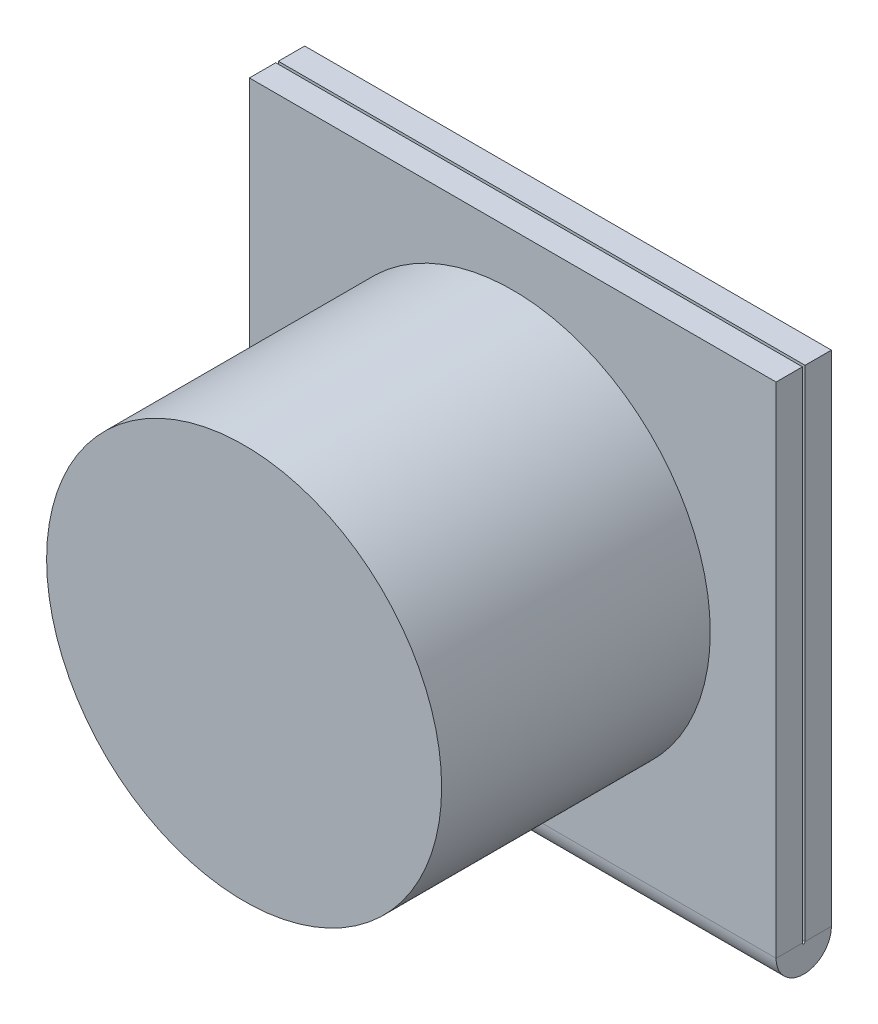
ISO-10303-21;
HEADER;
FILE_DESCRIPTION(('STEP AP214'),'2;1');
FILE_NAME('part.step','',(''),(''),'','','');
FILE_SCHEMA(('AUTOMOTIVE_DESIGN { 1 0 10303 214 1 1 1 1 }'));
ENDSEC;
DATA;
#1=APPLICATION_CONTEXT('core data for automotive mechanical design processes');
#2=APPLICATION_PROTOCOL_DEFINITION('international standard','automotive_design',2000,#1);
#3=PRODUCT_CONTEXT('',#1,'mechanical');
#4=PRODUCT('Part','Part','',(#3));
#5=PRODUCT_RELATED_PRODUCT_CATEGORY('part','',(#4));
#6=PRODUCT_DEFINITION_FORMATION('','',#4);
#7=PRODUCT_DEFINITION_CONTEXT('part definition',#1,'design');
#8=PRODUCT_DEFINITION('design','',#6,#7);
#9=PRODUCT_DEFINITION_SHAPE('','',#8);
#10=(LENGTH_UNIT() NAMED_UNIT(*) SI_UNIT(.MILLI.,.METRE.));
#11=(NAMED_UNIT(*) PLANE_ANGLE_UNIT() SI_UNIT($,.RADIAN.));
#12=(NAMED_UNIT(*) SI_UNIT($,.STERADIAN.) SOLID_ANGLE_UNIT());
#13=UNCERTAINTY_MEASURE_WITH_UNIT(LENGTH_MEASURE(1.E-05),#10,'distance_accuracy_value','');
#14=(GEOMETRIC_REPRESENTATION_CONTEXT(3) GLOBAL_UNCERTAINTY_ASSIGNED_CONTEXT((#13)) GLOBAL_UNIT_ASSIGNED_CONTEXT((#10,
#11,#12)) REPRESENTATION_CONTEXT('',''));
#15=CARTESIAN_POINT('',(0.,0.,0.));
#16=DIRECTION('',(0.,0.,1.));
#17=DIRECTION('',(1.,0.,0.));
#18=AXIS2_PLACEMENT_3D('',#15,#16,#17);
#19=CARTESIAN_POINT('',(20.,0.,-1.));
#20=DIRECTION('',(1.,0.,0.));
#21=DIRECTION('',(0.,0.,-1.));
#22=AXIS2_PLACEMENT_3D('',#19,#20,#21);
#23=PLANE('',#22);
#24=DIRECTION('',(0.,1.,0.));
#25=VECTOR('',#24,1.);
#26=CARTESIAN_POINT('',(20.,0.,0.));
#27=LINE('',#26,#25);
#28=CARTESIAN_POINT('',(20.,1.05000000000001,0.));
#29=VERTEX_POINT('',#28);
#30=CARTESIAN_POINT('',(20.,20.,0.));
#31=VERTEX_POINT('',#30);
#32=EDGE_CURVE('E87',#29,#31,#27,.T.);
#33=ORIENTED_EDGE('',*,*,#32,.F.);
#34=DIRECTION('',(0.,0.,-1.));
#35=VECTOR('',#34,1.);
#36=CARTESIAN_POINT('',(20.,1.05,0.));
#37=LINE('',#36,#35);
#38=CARTESIAN_POINT('',(20.,1.05,-1.));
#39=VERTEX_POINT('',#38);
#40=EDGE_CURVE('E136',#29,#39,#37,.T.);
#41=ORIENTED_EDGE('',*,*,#40,.T.);
#42=DIRECTION('',(0.,1.,0.));
#43=VECTOR('',#42,1.);
#44=CARTESIAN_POINT('',(20.,0.,-1.));
#45=LINE('',#44,#43);
#46=CARTESIAN_POINT('',(20.,20.,-1.));
#47=VERTEX_POINT('',#46);
#48=EDGE_CURVE('E95',#39,#47,#45,.T.);
#49=ORIENTED_EDGE('',*,*,#48,.T.);
#50=DIRECTION('',(0.,0.,1.));
#51=VECTOR('',#50,1.);
#52=CARTESIAN_POINT('',(20.,20.,-1.));
#53=LINE('',#52,#51);
#54=EDGE_CURVE('E42',#47,#31,#53,.T.);
#55=ORIENTED_EDGE('',*,*,#54,.T.);
#56=EDGE_LOOP('',(#33,#41,#49,#55));
#57=FACE_BOUND('',#56,.T.);
#58=ADVANCED_FACE('F38',(#57),#23,.T.);
#59=CARTESIAN_POINT('',(0.,0.,-1.));
#60=DIRECTION('',(-1.,0.,0.));
#61=DIRECTION('',(0.,0.,1.));
#62=AXIS2_PLACEMENT_3D('',#59,#60,#61);
#63=PLANE('',#62);
#64=DIRECTION('',(0.,0.,-1.));
#65=VECTOR('',#64,1.);
#66=CARTESIAN_POINT('',(0.,1.05,0.));
#67=LINE('',#66,#65);
#68=CARTESIAN_POINT('',(0.,1.05,0.));
#69=VERTEX_POINT('',#68);
#70=CARTESIAN_POINT('',(0.,1.05,-1.));
#71=VERTEX_POINT('',#70);
#72=EDGE_CURVE('E84',#69,#71,#67,.T.);
#73=ORIENTED_EDGE('',*,*,#72,.F.);
#74=DIRECTION('',(0.,-1.,0.));
#75=VECTOR('',#74,1.);
#76=CARTESIAN_POINT('',(0.,0.,0.));
#77=LINE('',#76,#75);
#78=CARTESIAN_POINT('',(0.,20.,0.));
#79=VERTEX_POINT('',#78);
#80=EDGE_CURVE('E81',#79,#69,#77,.T.);
#81=ORIENTED_EDGE('',*,*,#80,.F.);
#82=DIRECTION('',(0.,0.,1.));
#83=VECTOR('',#82,1.);
#84=CARTESIAN_POINT('',(0.,20.,-1.));
#85=LINE('',#84,#83);
#86=CARTESIAN_POINT('',(0.,20.,-1.));
#87=VERTEX_POINT('',#86);
#88=EDGE_CURVE('E11',#87,#79,#85,.T.);
#89=ORIENTED_EDGE('',*,*,#88,.F.);
#90=DIRECTION('',(0.,-1.,0.));
#91=VECTOR('',#90,1.);
#92=CARTESIAN_POINT('',(0.,0.,-1.));
#93=LINE('',#92,#91);
#94=EDGE_CURVE('E93',#87,#71,#93,.T.);
#95=ORIENTED_EDGE('',*,*,#94,.T.);
#96=EDGE_LOOP('',(#73,#81,#89,#95));
#97=FACE_BOUND('',#96,.T.);
#98=ADVANCED_FACE('F40',(#97),#63,.T.);
#99=CARTESIAN_POINT('',(0.,20.,-1.));
#100=DIRECTION('',(0.,1.,0.));
#101=DIRECTION('',(0.,0.,1.));
#102=AXIS2_PLACEMENT_3D('',#99,#100,#101);
#103=PLANE('',#102);
#104=DIRECTION('',(-1.,0.,0.));
#105=VECTOR('',#104,1.);
#106=CARTESIAN_POINT('',(0.,20.,0.));
#107=LINE('',#106,#105);
#108=EDGE_CURVE('E76',#31,#79,#107,.T.);
#109=ORIENTED_EDGE('',*,*,#108,.F.);
#110=ORIENTED_EDGE('',*,*,#54,.F.);
#111=DIRECTION('',(-1.,0.,0.));
#112=VECTOR('',#111,1.);
#113=CARTESIAN_POINT('',(0.,20.,-1.));
#114=LINE('',#113,#112);
#115=EDGE_CURVE('E78',#47,#87,#114,.T.);
#116=ORIENTED_EDGE('',*,*,#115,.T.);
#117=ORIENTED_EDGE('',*,*,#88,.T.);
#118=EDGE_LOOP('',(#109,#110,#116,#117));
#119=FACE_BOUND('',#118,.T.);
#120=ADVANCED_FACE('F73',(#119),#103,.T.);
#121=CARTESIAN_POINT('',(0.,0.,-1.));
#122=DIRECTION('',(0.,0.,-1.));
#123=DIRECTION('',(-1.,0.,0.));
#124=AXIS2_PLACEMENT_3D('',#121,#122,#123);
#125=PLANE('',#124);
#126=DIRECTION('',(1.,0.,0.));
#127=VECTOR('',#126,1.);
#128=CARTESIAN_POINT('',(20.,1.05,-1.));
#129=LINE('',#128,#127);
#130=EDGE_CURVE('E151',#39,#71,#129,.F.);
#131=ORIENTED_EDGE('',*,*,#130,.T.);
#132=ORIENTED_EDGE('',*,*,#94,.F.);
#133=ORIENTED_EDGE('',*,*,#115,.F.);
#134=ORIENTED_EDGE('',*,*,#48,.F.);
#135=EDGE_LOOP('',(#131,#132,#133,#134));
#136=FACE_BOUND('',#135,.T.);
#137=ADVANCED_FACE('F225',(#136),#125,.T.);
#138=CARTESIAN_POINT('',(0.,0.,0.));
#139=DIRECTION('',(0.,0.,-1.));
#140=DIRECTION('',(-1.,0.,0.));
#141=AXIS2_PLACEMENT_3D('',#138,#139,#140);
#142=PLANE('',#141);
#143=ORIENTED_EDGE('',*,*,#80,.T.);
#144=DIRECTION('',(1.,0.,0.));
#145=VECTOR('',#144,1.);
#146=CARTESIAN_POINT('',(20.,1.05,0.));
#147=LINE('',#146,#145);
#148=EDGE_CURVE('E142',#29,#69,#147,.F.);
#149=ORIENTED_EDGE('',*,*,#148,.F.);
#150=ORIENTED_EDGE('',*,*,#32,.T.);
#151=ORIENTED_EDGE('',*,*,#108,.T.);
#152=EDGE_LOOP('',(#143,#149,#150,#151));
#153=FACE_BOUND('',#152,.T.);
#154=ADVANCED_FACE('F90',(#153),#142,.F.);
#155=CARTESIAN_POINT('',(20.,10.525,1.1));
#156=DIRECTION('',(-1.,0.,0.));
#157=DIRECTION('',(0.,-1.,0.));
#158=AXIS2_PLACEMENT_3D('',#155,#156,#157);
#159=PLANE('',#158);
#160=DIRECTION('',(0.,0.,1.));
#161=VECTOR('',#160,1.);
#162=CARTESIAN_POINT('',(20.,1.05,1.1));
#163=LINE('',#162,#161);
#164=CARTESIAN_POINT('',(20.,1.05,0.1));
#165=VERTEX_POINT('',#164);
#166=CARTESIAN_POINT('',(20.,1.05,1.1));
#167=VERTEX_POINT('',#166);
#168=EDGE_CURVE('E108',#165,#167,#163,.T.);
#169=ORIENTED_EDGE('',*,*,#168,.F.);
#170=DIRECTION('',(0.,1.,0.));
#171=VECTOR('',#170,1.);
#172=CARTESIAN_POINT('',(20.,10.525,0.1));
#173=LINE('',#172,#171);
#174=CARTESIAN_POINT('',(20.,20.,0.1));
#175=VERTEX_POINT('',#174);
#176=EDGE_CURVE('E119',#175,#165,#173,.F.);
#177=ORIENTED_EDGE('',*,*,#176,.F.);
#178=DIRECTION('',(0.,0.,1.));
#179=VECTOR('',#178,1.);
#180=CARTESIAN_POINT('',(20.,20.,1.1));
#181=LINE('',#180,#179);
#182=CARTESIAN_POINT('',(20.,20.,1.1));
#183=VERTEX_POINT('',#182);
#184=EDGE_CURVE('E104',#175,#183,#181,.T.);
#185=ORIENTED_EDGE('',*,*,#184,.T.);
#186=DIRECTION('',(0.,-1.,0.));
#187=VECTOR('',#186,1.);
#188=CARTESIAN_POINT('',(20.,10.525,1.1));
#189=LINE('',#188,#187);
#190=EDGE_CURVE('E131',#183,#167,#189,.T.);
#191=ORIENTED_EDGE('',*,*,#190,.T.);
#192=EDGE_LOOP('',(#169,#177,#185,#191));
#193=FACE_BOUND('',#192,.T.);
#194=ADVANCED_FACE('F219',(#193),#159,.F.);
#195=CARTESIAN_POINT('',(10.,20.,1.1));
#196=DIRECTION('',(0.,-1.,0.));
#197=DIRECTION('',(1.,0.,0.));
#198=AXIS2_PLACEMENT_3D('',#195,#196,#197);
#199=PLANE('',#198);
#200=ORIENTED_EDGE('',*,*,#184,.F.);
#201=DIRECTION('',(1.,0.,0.));
#202=VECTOR('',#201,1.);
#203=CARTESIAN_POINT('',(10.,20.,0.1));
#204=LINE('',#203,#202);
#205=CARTESIAN_POINT('',(0.,20.,0.1));
#206=VERTEX_POINT('',#205);
#207=EDGE_CURVE('E122',#206,#175,#204,.T.);
#208=ORIENTED_EDGE('',*,*,#207,.F.);
#209=DIRECTION('',(0.,0.,1.));
#210=VECTOR('',#209,1.);
#211=CARTESIAN_POINT('',(0.,20.,1.1));
#212=LINE('',#211,#210);
#213=CARTESIAN_POINT('',(0.,20.,1.1));
#214=VERTEX_POINT('',#213);
#215=EDGE_CURVE('E101',#206,#214,#212,.T.);
#216=ORIENTED_EDGE('',*,*,#215,.T.);
#217=DIRECTION('',(1.,0.,0.));
#218=VECTOR('',#217,1.);
#219=CARTESIAN_POINT('',(10.,20.,1.1));
#220=LINE('',#219,#218);
#221=EDGE_CURVE('E105',#214,#183,#220,.T.);
#222=ORIENTED_EDGE('',*,*,#221,.T.);
#223=EDGE_LOOP('',(#200,#208,#216,#222));
#224=FACE_BOUND('',#223,.T.);
#225=ADVANCED_FACE('F188',(#224),#199,.F.);
#226=CARTESIAN_POINT('',(0.,10.525,1.1));
#227=DIRECTION('',(1.,0.,0.));
#228=DIRECTION('',(0.,1.,0.));
#229=AXIS2_PLACEMENT_3D('',#226,#227,#228);
#230=PLANE('',#229);
#231=DIRECTION('',(0.,1.,0.));
#232=VECTOR('',#231,1.);
#233=CARTESIAN_POINT('',(0.,10.525,0.1));
#234=LINE('',#233,#232);
#235=CARTESIAN_POINT('',(0.,1.05,0.1));
#236=VERTEX_POINT('',#235);
#237=EDGE_CURVE('E113',#236,#206,#234,.T.);
#238=ORIENTED_EDGE('',*,*,#237,.F.);
#239=DIRECTION('',(0.,0.,1.));
#240=VECTOR('',#239,1.);
#241=CARTESIAN_POINT('',(0.,1.05,1.1));
#242=LINE('',#241,#240);
#243=CARTESIAN_POINT('',(0.,1.05,1.1));
#244=VERTEX_POINT('',#243);
#245=EDGE_CURVE('E88',#236,#244,#242,.T.);
#246=ORIENTED_EDGE('',*,*,#245,.T.);
#247=DIRECTION('',(0.,1.,0.));
#248=VECTOR('',#247,1.);
#249=CARTESIAN_POINT('',(0.,10.525,1.1));
#250=LINE('',#249,#248);
#251=EDGE_CURVE('E125',#244,#214,#250,.T.);
#252=ORIENTED_EDGE('',*,*,#251,.T.);
#253=ORIENTED_EDGE('',*,*,#215,.F.);
#254=EDGE_LOOP('',(#238,#246,#252,#253));
#255=FACE_BOUND('',#254,.T.);
#256=ADVANCED_FACE('F175',(#255),#230,.F.);
#257=CARTESIAN_POINT('',(10.,10.525,1.1));
#258=DIRECTION('',(0.,0.,1.));
#259=DIRECTION('',(1.,0.,0.));
#260=AXIS2_PLACEMENT_3D('',#257,#258,#259);
#261=PLANE('',#260);
#262=CARTESIAN_POINT('',(10.,10.525,1.1));
#263=DIRECTION('',(0.,0.,1.));
#264=DIRECTION('',(1.,0.,0.));
#265=AXIS2_PLACEMENT_3D('',#262,#263,#264);
#266=CIRCLE('',#265,7.5);
#267=CARTESIAN_POINT('',(17.5,10.525,1.1));
#268=VERTEX_POINT('',#267);
#269=EDGE_CURVE('E156',#268,#268,#266,.T.);
#270=ORIENTED_EDGE('',*,*,#269,.F.);
#271=EDGE_LOOP('',(#270));
#272=FACE_BOUND('',#271,.T.);
#273=ORIENTED_EDGE('',*,*,#221,.F.);
#274=ORIENTED_EDGE('',*,*,#251,.F.);
#275=DIRECTION('',(-1.,0.,0.));
#276=VECTOR('',#275,1.);
#277=CARTESIAN_POINT('',(10.,1.05,1.1));
#278=LINE('',#277,#276);
#279=EDGE_CURVE('E128',#167,#244,#278,.T.);
#280=ORIENTED_EDGE('',*,*,#279,.F.);
#281=ORIENTED_EDGE('',*,*,#190,.F.);
#282=EDGE_LOOP('',(#273,#274,#280,#281));
#283=FACE_BOUND('',#282,.T.);
#284=ADVANCED_FACE('F171',(#272,#283),#261,.T.);
#285=CARTESIAN_POINT('',(10.,10.525,0.1));
#286=DIRECTION('',(0.,0.,1.));
#287=DIRECTION('',(1.,0.,0.));
#288=AXIS2_PLACEMENT_3D('',#285,#286,#287);
#289=PLANE('',#288);
#290=ORIENTED_EDGE('',*,*,#207,.T.);
#291=ORIENTED_EDGE('',*,*,#176,.T.);
#292=DIRECTION('',(1.,0.,0.));
#293=VECTOR('',#292,1.);
#294=CARTESIAN_POINT('',(10.,1.05,0.1));
#295=LINE('',#294,#293);
#296=EDGE_CURVE('E116',#165,#236,#295,.F.);
#297=ORIENTED_EDGE('',*,*,#296,.T.);
#298=ORIENTED_EDGE('',*,*,#237,.T.);
#299=EDGE_LOOP('',(#290,#291,#297,#298));
#300=FACE_BOUND('',#299,.T.);
#301=ADVANCED_FACE('F174',(#300),#289,.F.);
#302=CARTESIAN_POINT('',(0.,1.05,0.05));
#303=DIRECTION('',(-1.,0.,0.));
#304=DIRECTION('',(0.,0.,1.));
#305=AXIS2_PLACEMENT_3D('',#302,#303,#304);
#306=PLANE('',#305);
#307=ORIENTED_EDGE('',*,*,#245,.F.);
#308=CARTESIAN_POINT('',(0.,1.05,0.05));
#309=DIRECTION('',(1.,0.,0.));
#310=DIRECTION('',(0.,0.,-1.));
#311=AXIS2_PLACEMENT_3D('',#308,#309,#310);
#312=CIRCLE('',#311,0.05);
#313=EDGE_CURVE('E145',#69,#236,#312,.F.);
#314=ORIENTED_EDGE('',*,*,#313,.F.);
#315=ORIENTED_EDGE('',*,*,#72,.T.);
#316=CARTESIAN_POINT('',(0.,1.05,0.05));
#317=DIRECTION('',(1.,0.,0.));
#318=DIRECTION('',(0.,0.,-1.));
#319=AXIS2_PLACEMENT_3D('',#316,#317,#318);
#320=CIRCLE('',#319,1.05);
#321=EDGE_CURVE('E139',#71,#244,#320,.F.);
#322=ORIENTED_EDGE('',*,*,#321,.T.);
#323=EDGE_LOOP('',(#307,#314,#315,#322));
#324=FACE_BOUND('',#323,.T.);
#325=ADVANCED_FACE('F215',(#324),#306,.T.);
#326=CARTESIAN_POINT('',(20.,1.05,0.05));
#327=DIRECTION('',(-1.,0.,0.));
#328=DIRECTION('',(0.,0.,1.));
#329=AXIS2_PLACEMENT_3D('',#326,#327,#328);
#330=PLANE('',#329);
#331=CARTESIAN_POINT('',(20.,1.05,0.05));
#332=DIRECTION('',(1.,0.,0.));
#333=DIRECTION('',(0.,0.,-1.));
#334=AXIS2_PLACEMENT_3D('',#331,#332,#333);
#335=CIRCLE('',#334,0.05);
#336=EDGE_CURVE('E53',#165,#29,#335,.T.);
#337=ORIENTED_EDGE('',*,*,#336,.F.);
#338=ORIENTED_EDGE('',*,*,#168,.T.);
#339=CARTESIAN_POINT('',(20.,1.05,0.05));
#340=DIRECTION('',(1.,0.,0.));
#341=DIRECTION('',(0.,0.,-1.));
#342=AXIS2_PLACEMENT_3D('',#339,#340,#341);
#343=CIRCLE('',#342,1.05);
#344=EDGE_CURVE('E148',#167,#39,#343,.T.);
#345=ORIENTED_EDGE('',*,*,#344,.T.);
#346=ORIENTED_EDGE('',*,*,#40,.F.);
#347=EDGE_LOOP('',(#337,#338,#345,#346));
#348=FACE_BOUND('',#347,.T.);
#349=ADVANCED_FACE('F221',(#348),#330,.F.);
#350=CARTESIAN_POINT('',(20.,1.05,0.05));
#351=DIRECTION('',(1.,0.,0.));
#352=DIRECTION('',(0.,0.,1.));
#353=AXIS2_PLACEMENT_3D('',#350,#351,#352);
#354=CYLINDRICAL_SURFACE('',#353,1.05);
#355=ORIENTED_EDGE('',*,*,#130,.F.);
#356=ORIENTED_EDGE('',*,*,#344,.F.);
#357=ORIENTED_EDGE('',*,*,#279,.T.);
#358=ORIENTED_EDGE('',*,*,#321,.F.);
#359=EDGE_LOOP('',(#355,#356,#357,#358));
#360=FACE_BOUND('',#359,.T.);
#361=ADVANCED_FACE('F218',(#360),#354,.T.);
#362=CARTESIAN_POINT('',(20.,1.05,0.05));
#363=DIRECTION('',(1.,0.,0.));
#364=DIRECTION('',(0.,0.,1.));
#365=AXIS2_PLACEMENT_3D('',#362,#363,#364);
#366=CYLINDRICAL_SURFACE('',#365,0.05);
#367=ORIENTED_EDGE('',*,*,#148,.T.);
#368=ORIENTED_EDGE('',*,*,#313,.T.);
#369=ORIENTED_EDGE('',*,*,#296,.F.);
#370=ORIENTED_EDGE('',*,*,#336,.T.);
#371=EDGE_LOOP('',(#367,#368,#369,#370));
#372=FACE_BOUND('',#371,.T.);
#373=ADVANCED_FACE('F167',(#372),#366,.F.);
#374=CARTESIAN_POINT('',(10.,10.525,11.3));
#375=DIRECTION('',(0.,0.,-1.));
#376=DIRECTION('',(-1.,0.,0.));
#377=AXIS2_PLACEMENT_3D('',#374,#375,#376);
#378=CYLINDRICAL_SURFACE('',#377,7.5);
#379=CARTESIAN_POINT('',(10.,10.525,11.3));
#380=DIRECTION('',(0.,0.,1.));
#381=DIRECTION('',(1.,0.,0.));
#382=AXIS2_PLACEMENT_3D('',#379,#380,#381);
#383=CIRCLE('',#382,7.5);
#384=CARTESIAN_POINT('',(17.5,10.525,11.3));
#385=VERTEX_POINT('',#384);
#386=EDGE_CURVE('E143',#385,#385,#383,.T.);
#387=ORIENTED_EDGE('',*,*,#386,.F.);
#388=EDGE_LOOP('',(#387));
#389=FACE_BOUND('',#388,.T.);
#390=ORIENTED_EDGE('',*,*,#269,.T.);
#391=EDGE_LOOP('',(#390));
#392=FACE_BOUND('',#391,.T.);
#393=ADVANCED_FACE('F164',(#389,#392),#378,.T.);
#394=CARTESIAN_POINT('',(10.,10.525,11.3));
#395=DIRECTION('',(0.,0.,1.));
#396=DIRECTION('',(1.,0.,0.));
#397=AXIS2_PLACEMENT_3D('',#394,#395,#396);
#398=PLANE('',#397);
#399=ORIENTED_EDGE('',*,*,#386,.T.);
#400=EDGE_LOOP('',(#399));
#401=FACE_BOUND('',#400,.T.);
#402=ADVANCED_FACE('F162',(#401),#398,.T.);
#403=CLOSED_SHELL('',(#58,#98,#120,#137,#154,#194,#225,#256,#284,#301,#325,#349,#361,#373,#393,#402));
#404=MANIFOLD_SOLID_BREP('B2',#403);
#405=ADVANCED_BREP_SHAPE_REPRESENTATION('',(#18,#404),#14);
#406=SHAPE_DEFINITION_REPRESENTATION(#9,#405);
ENDSEC;
END-ISO-10303-21;
